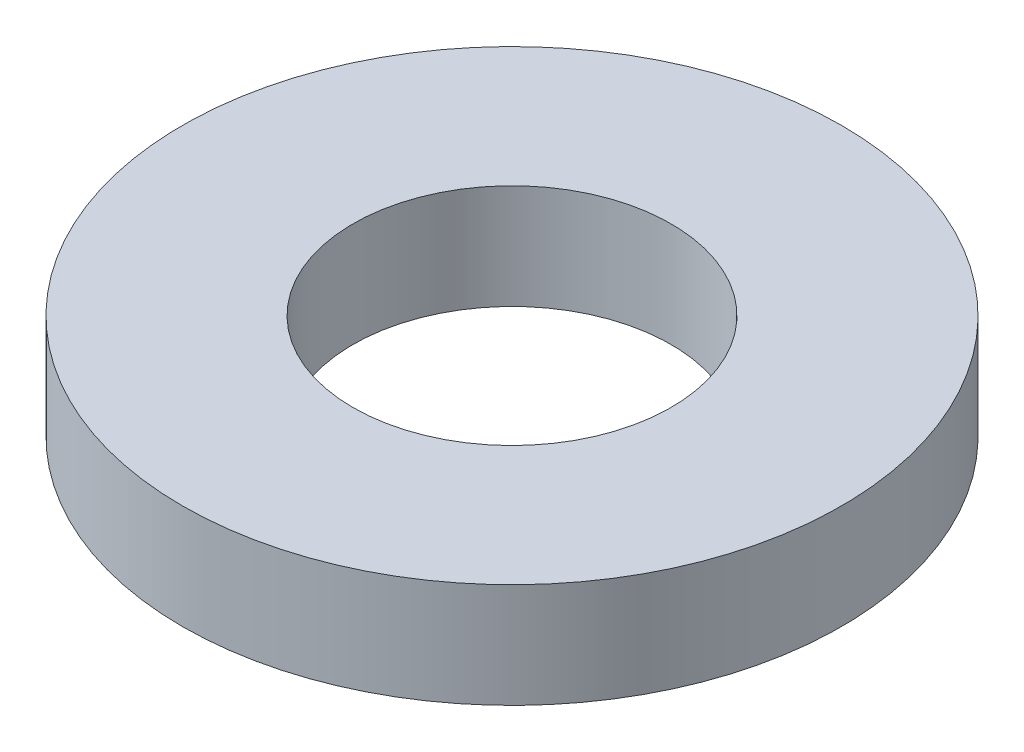
ISO-10303-21;
HEADER;
FILE_DESCRIPTION(('STEP AP214'),'2;1');
FILE_NAME('part.step','',(''),(''),'','','');
FILE_SCHEMA(('AUTOMOTIVE_DESIGN { 1 0 10303 214 1 1 1 1 }'));
ENDSEC;
DATA;
#1=APPLICATION_CONTEXT('core data for automotive mechanical design processes');
#2=APPLICATION_PROTOCOL_DEFINITION('international standard','automotive_design',2000,#1);
#3=PRODUCT_CONTEXT('',#1,'mechanical');
#4=PRODUCT('Part','Part','',(#3));
#5=PRODUCT_RELATED_PRODUCT_CATEGORY('part','',(#4));
#6=PRODUCT_DEFINITION_FORMATION('','',#4);
#7=PRODUCT_DEFINITION_CONTEXT('part definition',#1,'design');
#8=PRODUCT_DEFINITION('design','',#6,#7);
#9=PRODUCT_DEFINITION_SHAPE('','',#8);
#10=(LENGTH_UNIT() NAMED_UNIT(*) SI_UNIT(.MILLI.,.METRE.));
#11=(NAMED_UNIT(*) PLANE_ANGLE_UNIT() SI_UNIT($,.RADIAN.));
#12=(NAMED_UNIT(*) SI_UNIT($,.STERADIAN.) SOLID_ANGLE_UNIT());
#13=UNCERTAINTY_MEASURE_WITH_UNIT(LENGTH_MEASURE(1.E-05),#10,'distance_accuracy_value','');
#14=(GEOMETRIC_REPRESENTATION_CONTEXT(3) GLOBAL_UNCERTAINTY_ASSIGNED_CONTEXT((#13)) GLOBAL_UNIT_ASSIGNED_CONTEXT((#10,
#11,#12)) REPRESENTATION_CONTEXT('',''));
#15=CARTESIAN_POINT('',(0.,0.,0.));
#16=DIRECTION('',(0.,0.,1.));
#17=DIRECTION('',(1.,0.,0.));
#18=AXIS2_PLACEMENT_3D('',#15,#16,#17);
#19=CARTESIAN_POINT('',(0.,23.,0.));
#20=DIRECTION('',(0.,-1.,0.));
#21=DIRECTION('',(0.,0.,-1.));
#22=AXIS2_PLACEMENT_3D('',#19,#20,#21);
#23=CYLINDRICAL_SURFACE('',#22,72.5);
#24=CARTESIAN_POINT('',(0.,23.,0.));
#25=DIRECTION('',(0.,1.,0.));
#26=DIRECTION('',(0.,0.,1.));
#27=AXIS2_PLACEMENT_3D('',#24,#25,#26);
#28=CIRCLE('',#27,72.5);
#29=CARTESIAN_POINT('',(0.,23.,72.5));
#30=VERTEX_POINT('',#29);
#31=EDGE_CURVE('E10',#30,#30,#28,.T.);
#32=ORIENTED_EDGE('',*,*,#31,.F.);
#33=EDGE_LOOP('',(#32));
#34=FACE_BOUND('',#33,.T.);
#35=CARTESIAN_POINT('',(0.,0.,0.));
#36=DIRECTION('',(0.,1.,0.));
#37=DIRECTION('',(0.,0.,1.));
#38=AXIS2_PLACEMENT_3D('',#35,#36,#37);
#39=CIRCLE('',#38,72.5);
#40=CARTESIAN_POINT('',(0.,0.,72.5));
#41=VERTEX_POINT('',#40);
#42=EDGE_CURVE('E37',#41,#41,#39,.T.);
#43=ORIENTED_EDGE('',*,*,#42,.T.);
#44=EDGE_LOOP('',(#43));
#45=FACE_BOUND('',#44,.T.);
#46=ADVANCED_FACE('F40',(#34,#45),#23,.T.);
#47=CARTESIAN_POINT('',(0.,23.,0.));
#48=DIRECTION('',(0.,1.,0.));
#49=DIRECTION('',(0.,0.,1.));
#50=AXIS2_PLACEMENT_3D('',#47,#48,#49);
#51=PLANE('',#50);
#52=CARTESIAN_POINT('',(0.,23.,0.));
#53=DIRECTION('',(0.,1.,0.));
#54=DIRECTION('',(0.,0.,1.));
#55=AXIS2_PLACEMENT_3D('',#52,#53,#54);
#56=CIRCLE('',#55,35.);
#57=CARTESIAN_POINT('',(0.,23.,35.));
#58=VERTEX_POINT('',#57);
#59=EDGE_CURVE('E50',#58,#58,#56,.T.);
#60=ORIENTED_EDGE('',*,*,#59,.F.);
#61=EDGE_LOOP('',(#60));
#62=FACE_BOUND('',#61,.T.);
#63=ORIENTED_EDGE('',*,*,#31,.T.);
#64=EDGE_LOOP('',(#63));
#65=FACE_BOUND('',#64,.T.);
#66=ADVANCED_FACE('F59',(#62,#65),#51,.T.);
#67=CARTESIAN_POINT('',(0.,0.,0.));
#68=DIRECTION('',(0.,1.,0.));
#69=DIRECTION('',(0.,0.,1.));
#70=AXIS2_PLACEMENT_3D('',#67,#68,#69);
#71=PLANE('',#70);
#72=CARTESIAN_POINT('',(0.,0.,0.));
#73=DIRECTION('',(0.,1.,0.));
#74=DIRECTION('',(0.,0.,1.));
#75=AXIS2_PLACEMENT_3D('',#72,#73,#74);
#76=CIRCLE('',#75,35.);
#77=CARTESIAN_POINT('',(0.,0.,35.));
#78=VERTEX_POINT('',#77);
#79=EDGE_CURVE('E47',#78,#78,#76,.T.);
#80=ORIENTED_EDGE('',*,*,#79,.T.);
#81=EDGE_LOOP('',(#80));
#82=FACE_BOUND('',#81,.T.);
#83=ORIENTED_EDGE('',*,*,#42,.F.);
#84=EDGE_LOOP('',(#83));
#85=FACE_BOUND('',#84,.T.);
#86=ADVANCED_FACE('F58',(#82,#85),#71,.F.);
#87=CARTESIAN_POINT('',(0.,23.,0.));
#88=DIRECTION('',(0.,-1.,0.));
#89=DIRECTION('',(0.,0.,-1.));
#90=AXIS2_PLACEMENT_3D('',#87,#88,#89);
#91=CYLINDRICAL_SURFACE('',#90,35.);
#92=ORIENTED_EDGE('',*,*,#59,.T.);
#93=EDGE_LOOP('',(#92));
#94=FACE_BOUND('',#93,.T.);
#95=ORIENTED_EDGE('',*,*,#79,.F.);
#96=EDGE_LOOP('',(#95));
#97=FACE_BOUND('',#96,.T.);
#98=ADVANCED_FACE('F54',(#94,#97),#91,.F.);
#99=CLOSED_SHELL('',(#46,#66,#86,#98));
#100=MANIFOLD_SOLID_BREP('B2',#99);
#101=ADVANCED_BREP_SHAPE_REPRESENTATION('',(#18,#100),#14);
#102=SHAPE_DEFINITION_REPRESENTATION(#9,#101);
ENDSEC;
END-ISO-10303-21;
